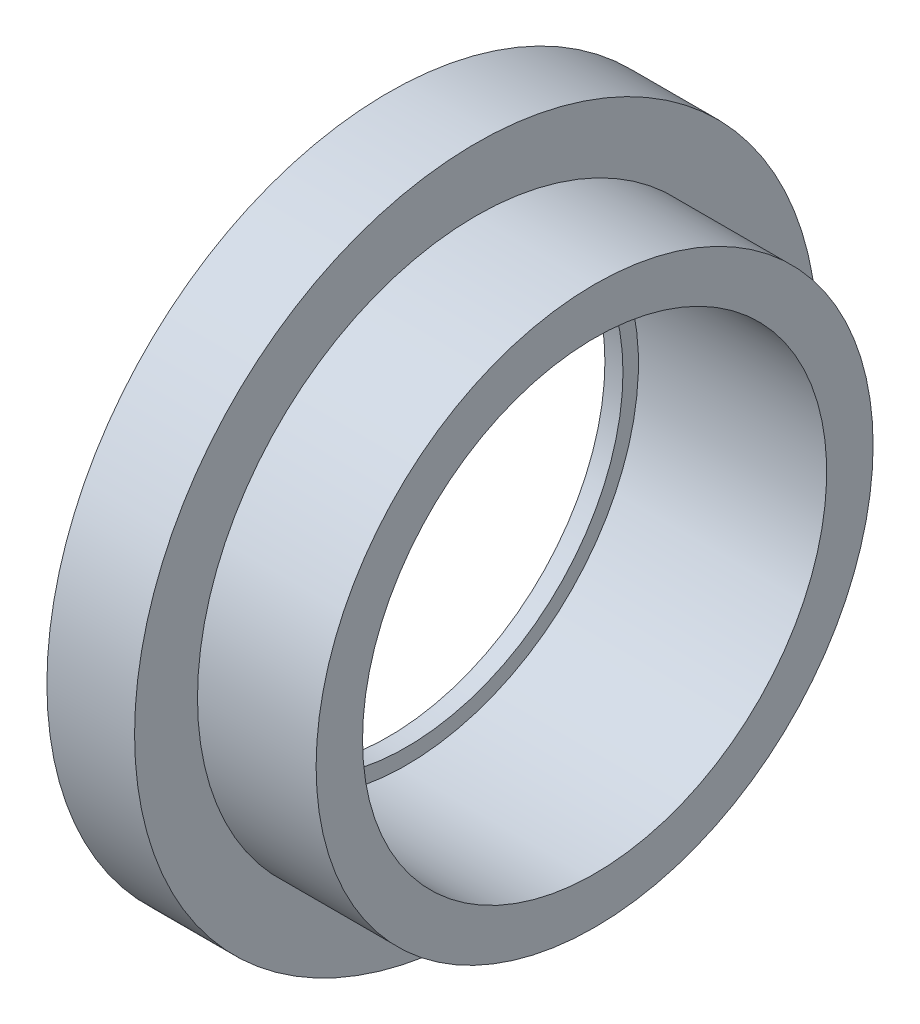
ISO-10303-21;
HEADER;
FILE_DESCRIPTION(('STEP AP214'),'2;1');
FILE_NAME('part.step','',(''),(''),'','','');
FILE_SCHEMA(('AUTOMOTIVE_DESIGN { 1 0 10303 214 1 1 1 1 }'));
ENDSEC;
DATA;
#1=APPLICATION_CONTEXT('core data for automotive mechanical design processes');
#2=APPLICATION_PROTOCOL_DEFINITION('international standard','automotive_design',2000,#1);
#3=PRODUCT_CONTEXT('',#1,'mechanical');
#4=PRODUCT('Part','Part','',(#3));
#5=PRODUCT_RELATED_PRODUCT_CATEGORY('part','',(#4));
#6=PRODUCT_DEFINITION_FORMATION('','',#4);
#7=PRODUCT_DEFINITION_CONTEXT('part definition',#1,'design');
#8=PRODUCT_DEFINITION('design','',#6,#7);
#9=PRODUCT_DEFINITION_SHAPE('','',#8);
#10=(LENGTH_UNIT() NAMED_UNIT(*) SI_UNIT(.MILLI.,.METRE.));
#11=(NAMED_UNIT(*) PLANE_ANGLE_UNIT() SI_UNIT($,.RADIAN.));
#12=(NAMED_UNIT(*) SI_UNIT($,.STERADIAN.) SOLID_ANGLE_UNIT());
#13=UNCERTAINTY_MEASURE_WITH_UNIT(LENGTH_MEASURE(1.E-05),#10,'distance_accuracy_value','');
#14=(GEOMETRIC_REPRESENTATION_CONTEXT(3) GLOBAL_UNCERTAINTY_ASSIGNED_CONTEXT((#13)) GLOBAL_UNIT_ASSIGNED_CONTEXT((#10,
#11,#12)) REPRESENTATION_CONTEXT('',''));
#15=CARTESIAN_POINT('',(0.,0.,0.));
#16=DIRECTION('',(0.,0.,1.));
#17=DIRECTION('',(1.,0.,0.));
#18=AXIS2_PLACEMENT_3D('',#15,#16,#17);
#19=CARTESIAN_POINT('',(13.5,0.,0.));
#20=DIRECTION('',(-1.,0.,0.));
#21=DIRECTION('',(0.,0.,1.));
#22=AXIS2_PLACEMENT_3D('',#19,#20,#21);
#23=CYLINDRICAL_SURFACE('',#22,54.);
#24=CARTESIAN_POINT('',(13.5,0.,0.));
#25=DIRECTION('',(-1.,0.,0.));
#26=DIRECTION('',(0.,0.,1.));
#27=AXIS2_PLACEMENT_3D('',#24,#25,#26);
#28=CIRCLE('',#27,54.);
#29=CARTESIAN_POINT('',(13.5,0.,54.));
#30=VERTEX_POINT('',#29);
#31=EDGE_CURVE('E38',#30,#30,#28,.T.);
#32=ORIENTED_EDGE('',*,*,#31,.F.);
#33=EDGE_LOOP('',(#32));
#34=FACE_BOUND('',#33,.T.);
#35=CARTESIAN_POINT('',(36.5,0.,0.));
#36=DIRECTION('',(-1.,0.,0.));
#37=DIRECTION('',(0.,0.,1.));
#38=AXIS2_PLACEMENT_3D('',#35,#36,#37);
#39=CIRCLE('',#38,54.);
#40=CARTESIAN_POINT('',(36.5,0.,54.));
#41=VERTEX_POINT('',#40);
#42=EDGE_CURVE('E16',#41,#41,#39,.F.);
#43=ORIENTED_EDGE('',*,*,#42,.F.);
#44=EDGE_LOOP('',(#43));
#45=FACE_BOUND('',#44,.T.);
#46=ADVANCED_FACE('F13',(#34,#45),#23,.T.);
#47=CARTESIAN_POINT('',(36.5,54.,54.6480021082327));
#48=DIRECTION('',(1.,0.,0.));
#49=DIRECTION('',(0.,-1.,0.));
#50=AXIS2_PLACEMENT_3D('',#47,#48,#49);
#51=PLANE('',#50);
#52=CARTESIAN_POINT('',(36.5,0.,0.));
#53=DIRECTION('',(-1.,0.,0.));
#54=DIRECTION('',(0.,0.,1.));
#55=AXIS2_PLACEMENT_3D('',#52,#53,#54);
#56=CIRCLE('',#55,45.);
#57=CARTESIAN_POINT('',(36.5,0.,45.));
#58=VERTEX_POINT('',#57);
#59=EDGE_CURVE('E36',#58,#58,#56,.F.);
#60=ORIENTED_EDGE('',*,*,#59,.F.);
#61=EDGE_LOOP('',(#60));
#62=FACE_BOUND('',#61,.T.);
#63=ORIENTED_EDGE('',*,*,#42,.T.);
#64=EDGE_LOOP('',(#63));
#65=FACE_BOUND('',#64,.T.);
#66=ADVANCED_FACE('F45',(#62,#65),#51,.T.);
#67=CARTESIAN_POINT('',(13.5,66.2000000000001,66.9944021082035));
#68=DIRECTION('',(1.,0.,0.));
#69=DIRECTION('',(0.,-1.,0.));
#70=AXIS2_PLACEMENT_3D('',#67,#68,#69);
#71=PLANE('',#70);
#72=ORIENTED_EDGE('',*,*,#31,.T.);
#73=EDGE_LOOP('',(#72));
#74=FACE_BOUND('',#73,.T.);
#75=CARTESIAN_POINT('',(13.5,0.,0.));
#76=DIRECTION('',(-1.,0.,0.));
#77=DIRECTION('',(0.,0.,1.));
#78=AXIS2_PLACEMENT_3D('',#75,#76,#77);
#79=CIRCLE('',#78,66.2);
#80=CARTESIAN_POINT('',(13.5,0.,66.2));
#81=VERTEX_POINT('',#80);
#82=EDGE_CURVE('E33',#81,#81,#79,.T.);
#83=ORIENTED_EDGE('',*,*,#82,.F.);
#84=EDGE_LOOP('',(#83));
#85=FACE_BOUND('',#84,.T.);
#86=ADVANCED_FACE('F53',(#74,#85),#71,.T.);
#87=CARTESIAN_POINT('',(36.5,0.,0.));
#88=DIRECTION('',(-1.,0.,0.));
#89=DIRECTION('',(0.,0.,1.));
#90=AXIS2_PLACEMENT_3D('',#87,#88,#89);
#91=CYLINDRICAL_SURFACE('',#90,45.);
#92=ORIENTED_EDGE('',*,*,#59,.T.);
#93=EDGE_LOOP('',(#92));
#94=FACE_BOUND('',#93,.T.);
#95=CARTESIAN_POINT('',(0.,0.,0.));
#96=DIRECTION('',(-1.,0.,0.));
#97=DIRECTION('',(0.,0.,1.));
#98=AXIS2_PLACEMENT_3D('',#95,#96,#97);
#99=CIRCLE('',#98,45.);
#100=CARTESIAN_POINT('',(0.,0.,45.));
#101=VERTEX_POINT('',#100);
#102=EDGE_CURVE('E30',#101,#101,#99,.F.);
#103=ORIENTED_EDGE('',*,*,#102,.F.);
#104=EDGE_LOOP('',(#103));
#105=FACE_BOUND('',#104,.T.);
#106=ADVANCED_FACE('F73',(#94,#105),#91,.F.);
#107=CARTESIAN_POINT('',(-3.50000000000003,0.,0.));
#108=DIRECTION('',(-1.,0.,0.));
#109=DIRECTION('',(0.,0.,1.));
#110=AXIS2_PLACEMENT_3D('',#107,#108,#109);
#111=CYLINDRICAL_SURFACE('',#110,66.2);
#112=CARTESIAN_POINT('',(-3.50000000000003,0.,0.));
#113=DIRECTION('',(-1.,0.,0.));
#114=DIRECTION('',(0.,0.,1.));
#115=AXIS2_PLACEMENT_3D('',#112,#113,#114);
#116=CIRCLE('',#115,66.2);
#117=CARTESIAN_POINT('',(-3.50000000000003,0.,66.2));
#118=VERTEX_POINT('',#117);
#119=EDGE_CURVE('E25',#118,#118,#116,.T.);
#120=ORIENTED_EDGE('',*,*,#119,.F.);
#121=EDGE_LOOP('',(#120));
#122=FACE_BOUND('',#121,.T.);
#123=ORIENTED_EDGE('',*,*,#82,.T.);
#124=EDGE_LOOP('',(#123));
#125=FACE_BOUND('',#124,.T.);
#126=ADVANCED_FACE('F69',(#122,#125),#111,.T.);
#127=CARTESIAN_POINT('',(0.,45.,45.5400021084173));
#128=DIRECTION('',(1.,0.,0.));
#129=DIRECTION('',(0.,-1.,0.));
#130=AXIS2_PLACEMENT_3D('',#127,#128,#129);
#131=PLANE('',#130);
#132=CARTESIAN_POINT('',(0.,0.,0.));
#133=DIRECTION('',(-1.,0.,0.));
#134=DIRECTION('',(0.,0.,1.));
#135=AXIS2_PLACEMENT_3D('',#132,#133,#134);
#136=CIRCLE('',#135,42.);
#137=CARTESIAN_POINT('',(0.,0.,42.));
#138=VERTEX_POINT('',#137);
#139=EDGE_CURVE('E20',#138,#138,#136,.F.);
#140=ORIENTED_EDGE('',*,*,#139,.F.);
#141=EDGE_LOOP('',(#140));
#142=FACE_BOUND('',#141,.T.);
#143=ORIENTED_EDGE('',*,*,#102,.T.);
#144=EDGE_LOOP('',(#143));
#145=FACE_BOUND('',#144,.T.);
#146=ADVANCED_FACE('F63',(#142,#145),#131,.T.);
#147=CARTESIAN_POINT('',(-3.5,-66.2,66.9944021084176));
#148=DIRECTION('',(-1.,0.,0.));
#149=DIRECTION('',(0.,1.,0.));
#150=AXIS2_PLACEMENT_3D('',#147,#148,#149);
#151=PLANE('',#150);
#152=CARTESIAN_POINT('',(-3.50000000000002,0.,0.));
#153=DIRECTION('',(-1.,0.,0.));
#154=DIRECTION('',(0.,0.,1.));
#155=AXIS2_PLACEMENT_3D('',#152,#153,#154);
#156=CIRCLE('',#155,42.);
#157=CARTESIAN_POINT('',(-3.50000000000002,0.,42.));
#158=VERTEX_POINT('',#157);
#159=EDGE_CURVE('E8',#158,#158,#156,.T.);
#160=ORIENTED_EDGE('',*,*,#159,.F.);
#161=EDGE_LOOP('',(#160));
#162=FACE_BOUND('',#161,.T.);
#163=ORIENTED_EDGE('',*,*,#119,.T.);
#164=EDGE_LOOP('',(#163));
#165=FACE_BOUND('',#164,.T.);
#166=ADVANCED_FACE('F57',(#162,#165),#151,.T.);
#167=CARTESIAN_POINT('',(0.,0.,0.));
#168=DIRECTION('',(-1.,0.,0.));
#169=DIRECTION('',(0.,0.,1.));
#170=AXIS2_PLACEMENT_3D('',#167,#168,#169);
#171=CYLINDRICAL_SURFACE('',#170,42.);
#172=ORIENTED_EDGE('',*,*,#139,.T.);
#173=EDGE_LOOP('',(#172));
#174=FACE_BOUND('',#173,.T.);
#175=ORIENTED_EDGE('',*,*,#159,.T.);
#176=EDGE_LOOP('',(#175));
#177=FACE_BOUND('',#176,.T.);
#178=ADVANCED_FACE('F55',(#174,#177),#171,.F.);
#179=CLOSED_SHELL('',(#46,#66,#86,#106,#126,#146,#166,#178));
#180=MANIFOLD_SOLID_BREP('B1',#179);
#181=ADVANCED_BREP_SHAPE_REPRESENTATION('',(#18,#180),#14);
#182=SHAPE_DEFINITION_REPRESENTATION(#9,#181);
ENDSEC;
END-ISO-10303-21;
